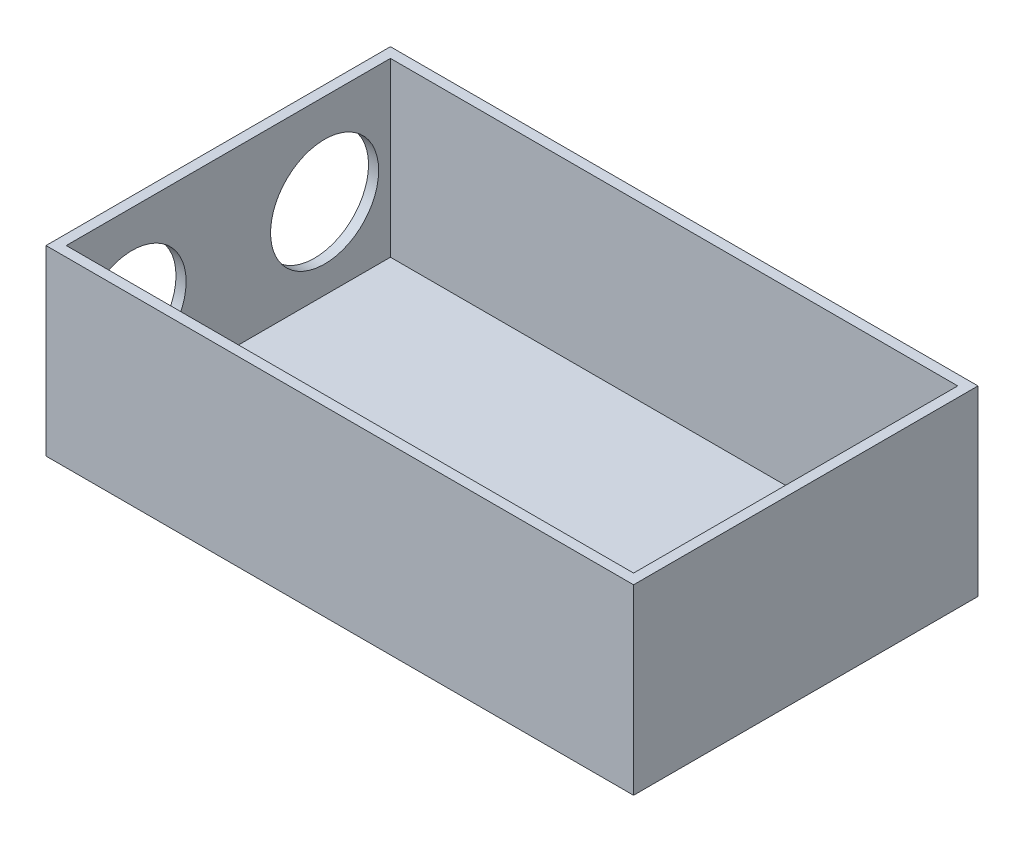
ISO-10303-21;
HEADER;
FILE_DESCRIPTION(('STEP AP214'),'2;1');
FILE_NAME('part.step','',(''),(''),'','','');
FILE_SCHEMA(('AUTOMOTIVE_DESIGN { 1 0 10303 214 1 1 1 1 }'));
ENDSEC;
DATA;
#1=APPLICATION_CONTEXT('core data for automotive mechanical design processes');
#2=APPLICATION_PROTOCOL_DEFINITION('international standard','automotive_design',2000,#1);
#3=PRODUCT_CONTEXT('',#1,'mechanical');
#4=PRODUCT('Part','Part','',(#3));
#5=PRODUCT_RELATED_PRODUCT_CATEGORY('part','',(#4));
#6=PRODUCT_DEFINITION_FORMATION('','',#4);
#7=PRODUCT_DEFINITION_CONTEXT('part definition',#1,'design');
#8=PRODUCT_DEFINITION('design','',#6,#7);
#9=PRODUCT_DEFINITION_SHAPE('','',#8);
#10=(LENGTH_UNIT() NAMED_UNIT(*) SI_UNIT(.MILLI.,.METRE.));
#11=(NAMED_UNIT(*) PLANE_ANGLE_UNIT() SI_UNIT($,.RADIAN.));
#12=(NAMED_UNIT(*) SI_UNIT($,.STERADIAN.) SOLID_ANGLE_UNIT());
#13=UNCERTAINTY_MEASURE_WITH_UNIT(LENGTH_MEASURE(1.E-05),#10,'distance_accuracy_value','');
#14=(GEOMETRIC_REPRESENTATION_CONTEXT(3) GLOBAL_UNCERTAINTY_ASSIGNED_CONTEXT((#13)) GLOBAL_UNIT_ASSIGNED_CONTEXT((#10,
#11,#12)) REPRESENTATION_CONTEXT('',''));
#15=CARTESIAN_POINT('',(0.,0.,0.));
#16=DIRECTION('',(0.,0.,1.));
#17=DIRECTION('',(1.,0.,0.));
#18=AXIS2_PLACEMENT_3D('',#15,#16,#17);
#19=CARTESIAN_POINT('',(180.,45.,-85.));
#20=DIRECTION('',(0.,0.,1.));
#21=DIRECTION('',(1.,0.,0.));
#22=AXIS2_PLACEMENT_3D('',#19,#20,#21);
#23=PLANE('',#22);
#24=DIRECTION('',(-1.,0.,0.));
#25=VECTOR('',#24,1.);
#26=CARTESIAN_POINT('',(180.,-45.,-85.));
#27=LINE('',#26,#25);
#28=CARTESIAN_POINT('',(180.,-45.,-85.));
#29=VERTEX_POINT('',#28);
#30=CARTESIAN_POINT('',(-110.,-45.,-84.9999999999999));
#31=VERTEX_POINT('',#30);
#32=EDGE_CURVE('E169',#29,#31,#27,.T.);
#33=ORIENTED_EDGE('',*,*,#32,.T.);
#34=DIRECTION('',(0.,-1.,0.));
#35=VECTOR('',#34,1.);
#36=CARTESIAN_POINT('',(-110.,45.,-84.9999999999999));
#37=LINE('',#36,#35);
#38=CARTESIAN_POINT('',(-110.,45.,-84.9999999999999));
#39=VERTEX_POINT('',#38);
#40=EDGE_CURVE('E11',#39,#31,#37,.T.);
#41=ORIENTED_EDGE('',*,*,#40,.F.);
#42=DIRECTION('',(-1.,0.,0.));
#43=VECTOR('',#42,1.);
#44=CARTESIAN_POINT('',(180.,45.,-85.));
#45=LINE('',#44,#43);
#46=CARTESIAN_POINT('',(180.,45.,-85.));
#47=VERTEX_POINT('',#46);
#48=EDGE_CURVE('E158',#47,#39,#45,.T.);
#49=ORIENTED_EDGE('',*,*,#48,.F.);
#50=DIRECTION('',(0.,-1.,0.));
#51=VECTOR('',#50,1.);
#52=CARTESIAN_POINT('',(180.,45.,-85.));
#53=LINE('',#52,#51);
#54=EDGE_CURVE('E168',#47,#29,#53,.T.);
#55=ORIENTED_EDGE('',*,*,#54,.T.);
#56=EDGE_LOOP('',(#33,#41,#49,#55));
#57=FACE_BOUND('',#56,.T.);
#58=ADVANCED_FACE('F39',(#57),#23,.F.);
#59=CARTESIAN_POINT('',(-110.,45.,-84.9999999999999));
#60=DIRECTION('',(1.,0.,0.));
#61=DIRECTION('',(0.,0.,-1.));
#62=AXIS2_PLACEMENT_3D('',#59,#60,#61);
#63=PLANE('',#62);
#64=CARTESIAN_POINT('',(-110.,0.,-47.5149842818787));
#65=DIRECTION('',(1.,0.,0.));
#66=DIRECTION('',(0.,0.,-1.));
#67=AXIS2_PLACEMENT_3D('',#64,#65,#66);
#68=CIRCLE('',#67,26.67);
#69=CARTESIAN_POINT('',(-110.,0.,-74.1849842818787));
#70=VERTEX_POINT('',#69);
#71=EDGE_CURVE('E201',#70,#70,#68,.T.);
#72=ORIENTED_EDGE('',*,*,#71,.T.);
#73=EDGE_LOOP('',(#72));
#74=FACE_BOUND('',#73,.T.);
#75=CARTESIAN_POINT('',(-110.,0.,47.5149842818787));
#76=DIRECTION('',(1.,0.,0.));
#77=DIRECTION('',(0.,0.,-1.));
#78=AXIS2_PLACEMENT_3D('',#75,#76,#77);
#79=CIRCLE('',#78,26.67);
#80=CARTESIAN_POINT('',(-110.,0.,20.8449842818787));
#81=VERTEX_POINT('',#80);
#82=EDGE_CURVE('E191',#81,#81,#79,.T.);
#83=ORIENTED_EDGE('',*,*,#82,.T.);
#84=EDGE_LOOP('',(#83));
#85=FACE_BOUND('',#84,.T.);
#86=DIRECTION('',(0.,0.,1.));
#87=VECTOR('',#86,1.);
#88=CARTESIAN_POINT('',(-110.,-45.,-84.9999999999999));
#89=LINE('',#88,#87);
#90=CARTESIAN_POINT('',(-110.,-45.,85.));
#91=VERTEX_POINT('',#90);
#92=EDGE_CURVE('E173',#31,#91,#89,.T.);
#93=ORIENTED_EDGE('',*,*,#92,.T.);
#94=DIRECTION('',(0.,-1.,0.));
#95=VECTOR('',#94,1.);
#96=CARTESIAN_POINT('',(-110.,45.,85.));
#97=LINE('',#96,#95);
#98=CARTESIAN_POINT('',(-110.,45.,85.));
#99=VERTEX_POINT('',#98);
#100=EDGE_CURVE('E48',#99,#91,#97,.T.);
#101=ORIENTED_EDGE('',*,*,#100,.F.);
#102=DIRECTION('',(0.,0.,1.));
#103=VECTOR('',#102,1.);
#104=CARTESIAN_POINT('',(-110.,45.,-84.9999999999999));
#105=LINE('',#104,#103);
#106=EDGE_CURVE('E93',#39,#99,#105,.T.);
#107=ORIENTED_EDGE('',*,*,#106,.F.);
#108=ORIENTED_EDGE('',*,*,#40,.T.);
#109=EDGE_LOOP('',(#93,#101,#107,#108));
#110=FACE_BOUND('',#109,.T.);
#111=ADVANCED_FACE('F228',(#74,#85,#110),#63,.F.);
#112=CARTESIAN_POINT('',(180.,45.,85.));
#113=DIRECTION('',(0.,0.,-1.));
#114=DIRECTION('',(-1.,0.,0.));
#115=AXIS2_PLACEMENT_3D('',#112,#113,#114);
#116=PLANE('',#115);
#117=DIRECTION('',(1.,0.,0.));
#118=VECTOR('',#117,1.);
#119=CARTESIAN_POINT('',(180.,-45.,85.));
#120=LINE('',#119,#118);
#121=CARTESIAN_POINT('',(180.,-45.,85.));
#122=VERTEX_POINT('',#121);
#123=EDGE_CURVE('E176',#91,#122,#120,.T.);
#124=ORIENTED_EDGE('',*,*,#123,.T.);
#125=DIRECTION('',(0.,-1.,0.));
#126=VECTOR('',#125,1.);
#127=CARTESIAN_POINT('',(180.,45.,85.));
#128=LINE('',#127,#126);
#129=CARTESIAN_POINT('',(180.,45.,85.));
#130=VERTEX_POINT('',#129);
#131=EDGE_CURVE('E183',#130,#122,#128,.T.);
#132=ORIENTED_EDGE('',*,*,#131,.F.);
#133=DIRECTION('',(1.,0.,0.));
#134=VECTOR('',#133,1.);
#135=CARTESIAN_POINT('',(180.,45.,85.));
#136=LINE('',#135,#134);
#137=EDGE_CURVE('E163',#99,#130,#136,.T.);
#138=ORIENTED_EDGE('',*,*,#137,.F.);
#139=ORIENTED_EDGE('',*,*,#100,.T.);
#140=EDGE_LOOP('',(#124,#132,#138,#139));
#141=FACE_BOUND('',#140,.T.);
#142=ADVANCED_FACE('F233',(#141),#116,.F.);
#143=CARTESIAN_POINT('',(180.,45.,-85.));
#144=DIRECTION('',(-1.,0.,0.));
#145=DIRECTION('',(0.,0.,1.));
#146=AXIS2_PLACEMENT_3D('',#143,#144,#145);
#147=PLANE('',#146);
#148=DIRECTION('',(0.,0.,-1.));
#149=VECTOR('',#148,1.);
#150=CARTESIAN_POINT('',(180.,-45.,-85.));
#151=LINE('',#150,#149);
#152=EDGE_CURVE('E86',#122,#29,#151,.T.);
#153=ORIENTED_EDGE('',*,*,#152,.T.);
#154=ORIENTED_EDGE('',*,*,#54,.F.);
#155=DIRECTION('',(0.,0.,-1.));
#156=VECTOR('',#155,1.);
#157=CARTESIAN_POINT('',(180.,45.,-85.));
#158=LINE('',#157,#156);
#159=EDGE_CURVE('E65',#130,#47,#158,.T.);
#160=ORIENTED_EDGE('',*,*,#159,.F.);
#161=ORIENTED_EDGE('',*,*,#131,.T.);
#162=EDGE_LOOP('',(#153,#154,#160,#161));
#163=FACE_BOUND('',#162,.T.);
#164=ADVANCED_FACE('F222',(#163),#147,.F.);
#165=CARTESIAN_POINT('',(0.,45.,0.));
#166=DIRECTION('',(0.,1.,0.));
#167=DIRECTION('',(0.,0.,1.));
#168=AXIS2_PLACEMENT_3D('',#165,#166,#167);
#169=PLANE('',#168);
#170=DIRECTION('',(-1.,0.,0.));
#171=VECTOR('',#170,1.);
#172=CARTESIAN_POINT('',(180.,45.,-80.));
#173=LINE('',#172,#171);
#174=CARTESIAN_POINT('',(175.,45.,-80.));
#175=VERTEX_POINT('',#174);
#176=CARTESIAN_POINT('',(-105.,45.,-79.9999999999999));
#177=VERTEX_POINT('',#176);
#178=EDGE_CURVE('E142',#175,#177,#173,.T.);
#179=ORIENTED_EDGE('',*,*,#178,.F.);
#180=DIRECTION('',(0.,0.,-1.));
#181=VECTOR('',#180,1.);
#182=CARTESIAN_POINT('',(175.,45.,-85.));
#183=LINE('',#182,#181);
#184=CARTESIAN_POINT('',(175.,45.,80.));
#185=VERTEX_POINT('',#184);
#186=EDGE_CURVE('E155',#185,#175,#183,.T.);
#187=ORIENTED_EDGE('',*,*,#186,.F.);
#188=DIRECTION('',(1.,0.,0.));
#189=VECTOR('',#188,1.);
#190=CARTESIAN_POINT('',(180.,45.,80.));
#191=LINE('',#190,#189);
#192=CARTESIAN_POINT('',(-105.,45.,80.));
#193=VERTEX_POINT('',#192);
#194=EDGE_CURVE('E152',#193,#185,#191,.T.);
#195=ORIENTED_EDGE('',*,*,#194,.F.);
#196=DIRECTION('',(0.,0.,1.));
#197=VECTOR('',#196,1.);
#198=CARTESIAN_POINT('',(-105.,45.,-84.9999999999999));
#199=LINE('',#198,#197);
#200=EDGE_CURVE('E131',#177,#193,#199,.T.);
#201=ORIENTED_EDGE('',*,*,#200,.F.);
#202=EDGE_LOOP('',(#179,#187,#195,#201));
#203=FACE_BOUND('',#202,.T.);
#204=ORIENTED_EDGE('',*,*,#48,.T.);
#205=ORIENTED_EDGE('',*,*,#106,.T.);
#206=ORIENTED_EDGE('',*,*,#137,.T.);
#207=ORIENTED_EDGE('',*,*,#159,.T.);
#208=EDGE_LOOP('',(#204,#205,#206,#207));
#209=FACE_BOUND('',#208,.T.);
#210=ADVANCED_FACE('F219',(#203,#209),#169,.T.);
#211=CARTESIAN_POINT('',(0.,-45.,0.));
#212=DIRECTION('',(0.,1.,0.));
#213=DIRECTION('',(0.,0.,1.));
#214=AXIS2_PLACEMENT_3D('',#211,#212,#213);
#215=PLANE('',#214);
#216=ORIENTED_EDGE('',*,*,#32,.F.);
#217=ORIENTED_EDGE('',*,*,#152,.F.);
#218=ORIENTED_EDGE('',*,*,#123,.F.);
#219=ORIENTED_EDGE('',*,*,#92,.F.);
#220=EDGE_LOOP('',(#216,#217,#218,#219));
#221=FACE_BOUND('',#220,.T.);
#222=ADVANCED_FACE('F221',(#221),#215,.F.);
#223=CARTESIAN_POINT('',(180.,45.,-80.));
#224=DIRECTION('',(0.,0.,1.));
#225=DIRECTION('',(1.,0.,0.));
#226=AXIS2_PLACEMENT_3D('',#223,#224,#225);
#227=PLANE('',#226);
#228=DIRECTION('',(-1.,0.,0.));
#229=VECTOR('',#228,1.);
#230=CARTESIAN_POINT('',(180.,-40.,-80.));
#231=LINE('',#230,#229);
#232=CARTESIAN_POINT('',(175.,-40.,-80.));
#233=VERTEX_POINT('',#232);
#234=CARTESIAN_POINT('',(-105.,-40.,-79.9999999999999));
#235=VERTEX_POINT('',#234);
#236=EDGE_CURVE('E121',#233,#235,#231,.T.);
#237=ORIENTED_EDGE('',*,*,#236,.F.);
#238=DIRECTION('',(0.,-1.,0.));
#239=VECTOR('',#238,1.);
#240=CARTESIAN_POINT('',(175.,45.,-80.));
#241=LINE('',#240,#239);
#242=EDGE_CURVE('E146',#175,#233,#241,.T.);
#243=ORIENTED_EDGE('',*,*,#242,.F.);
#244=ORIENTED_EDGE('',*,*,#178,.T.);
#245=DIRECTION('',(0.,-1.,0.));
#246=VECTOR('',#245,1.);
#247=CARTESIAN_POINT('',(-105.,45.,-79.9999999999999));
#248=LINE('',#247,#246);
#249=EDGE_CURVE('E135',#177,#235,#248,.T.);
#250=ORIENTED_EDGE('',*,*,#249,.T.);
#251=EDGE_LOOP('',(#237,#243,#244,#250));
#252=FACE_BOUND('',#251,.T.);
#253=ADVANCED_FACE('F217',(#252),#227,.T.);
#254=CARTESIAN_POINT('',(-105.,45.,-84.9999999999999));
#255=DIRECTION('',(1.,0.,0.));
#256=DIRECTION('',(0.,0.,-1.));
#257=AXIS2_PLACEMENT_3D('',#254,#255,#256);
#258=PLANE('',#257);
#259=CARTESIAN_POINT('',(-105.,0.,-47.5149842818787));
#260=DIRECTION('',(1.,0.,0.));
#261=DIRECTION('',(0.,0.,-1.));
#262=AXIS2_PLACEMENT_3D('',#259,#260,#261);
#263=CIRCLE('',#262,26.67);
#264=CARTESIAN_POINT('',(-105.,0.,-74.1849842818787));
#265=VERTEX_POINT('',#264);
#266=EDGE_CURVE('E42',#265,#265,#263,.T.);
#267=ORIENTED_EDGE('',*,*,#266,.F.);
#268=EDGE_LOOP('',(#267));
#269=FACE_BOUND('',#268,.T.);
#270=CARTESIAN_POINT('',(-105.,0.,47.5149842818787));
#271=DIRECTION('',(1.,0.,0.));
#272=DIRECTION('',(0.,0.,-1.));
#273=AXIS2_PLACEMENT_3D('',#270,#271,#272);
#274=CIRCLE('',#273,26.67);
#275=CARTESIAN_POINT('',(-105.,0.,20.8449842818787));
#276=VERTEX_POINT('',#275);
#277=EDGE_CURVE('E188',#276,#276,#274,.T.);
#278=ORIENTED_EDGE('',*,*,#277,.F.);
#279=EDGE_LOOP('',(#278));
#280=FACE_BOUND('',#279,.T.);
#281=DIRECTION('',(0.,0.,1.));
#282=VECTOR('',#281,1.);
#283=CARTESIAN_POINT('',(-105.,-40.,-84.9999999999999));
#284=LINE('',#283,#282);
#285=CARTESIAN_POINT('',(-105.,-40.,80.));
#286=VERTEX_POINT('',#285);
#287=EDGE_CURVE('E115',#235,#286,#284,.T.);
#288=ORIENTED_EDGE('',*,*,#287,.F.);
#289=ORIENTED_EDGE('',*,*,#249,.F.);
#290=ORIENTED_EDGE('',*,*,#200,.T.);
#291=DIRECTION('',(0.,-1.,0.));
#292=VECTOR('',#291,1.);
#293=CARTESIAN_POINT('',(-105.,45.,80.));
#294=LINE('',#293,#292);
#295=EDGE_CURVE('E128',#193,#286,#294,.T.);
#296=ORIENTED_EDGE('',*,*,#295,.T.);
#297=EDGE_LOOP('',(#288,#289,#290,#296));
#298=FACE_BOUND('',#297,.T.);
#299=ADVANCED_FACE('F129',(#269,#280,#298),#258,.T.);
#300=CARTESIAN_POINT('',(180.,45.,80.));
#301=DIRECTION('',(0.,0.,-1.));
#302=DIRECTION('',(-1.,0.,0.));
#303=AXIS2_PLACEMENT_3D('',#300,#301,#302);
#304=PLANE('',#303);
#305=DIRECTION('',(1.,0.,0.));
#306=VECTOR('',#305,1.);
#307=CARTESIAN_POINT('',(180.,-40.,80.));
#308=LINE('',#307,#306);
#309=CARTESIAN_POINT('',(175.,-40.,80.));
#310=VERTEX_POINT('',#309);
#311=EDGE_CURVE('E119',#286,#310,#308,.T.);
#312=ORIENTED_EDGE('',*,*,#311,.F.);
#313=ORIENTED_EDGE('',*,*,#295,.F.);
#314=ORIENTED_EDGE('',*,*,#194,.T.);
#315=DIRECTION('',(0.,-1.,0.));
#316=VECTOR('',#315,1.);
#317=CARTESIAN_POINT('',(175.,45.,80.));
#318=LINE('',#317,#316);
#319=EDGE_CURVE('E56',#185,#310,#318,.T.);
#320=ORIENTED_EDGE('',*,*,#319,.T.);
#321=EDGE_LOOP('',(#312,#313,#314,#320));
#322=FACE_BOUND('',#321,.T.);
#323=ADVANCED_FACE('F137',(#322),#304,.T.);
#324=CARTESIAN_POINT('',(175.,45.,-85.));
#325=DIRECTION('',(-1.,0.,0.));
#326=DIRECTION('',(0.,0.,1.));
#327=AXIS2_PLACEMENT_3D('',#324,#325,#326);
#328=PLANE('',#327);
#329=DIRECTION('',(0.,0.,-1.));
#330=VECTOR('',#329,1.);
#331=CARTESIAN_POINT('',(175.,-40.,-85.));
#332=LINE('',#331,#330);
#333=EDGE_CURVE('E139',#310,#233,#332,.T.);
#334=ORIENTED_EDGE('',*,*,#333,.F.);
#335=ORIENTED_EDGE('',*,*,#319,.F.);
#336=ORIENTED_EDGE('',*,*,#186,.T.);
#337=ORIENTED_EDGE('',*,*,#242,.T.);
#338=EDGE_LOOP('',(#334,#335,#336,#337));
#339=FACE_BOUND('',#338,.T.);
#340=ADVANCED_FACE('F213',(#339),#328,.T.);
#341=CARTESIAN_POINT('',(0.,-40.,0.));
#342=DIRECTION('',(0.,1.,0.));
#343=DIRECTION('',(0.,0.,1.));
#344=AXIS2_PLACEMENT_3D('',#341,#342,#343);
#345=PLANE('',#344);
#346=ORIENTED_EDGE('',*,*,#236,.T.);
#347=ORIENTED_EDGE('',*,*,#287,.T.);
#348=ORIENTED_EDGE('',*,*,#311,.T.);
#349=ORIENTED_EDGE('',*,*,#333,.T.);
#350=EDGE_LOOP('',(#346,#347,#348,#349));
#351=FACE_BOUND('',#350,.T.);
#352=ADVANCED_FACE('F117',(#351),#345,.T.);
#353=CARTESIAN_POINT('',(-70.,0.,47.5149842818787));
#354=DIRECTION('',(-1.,0.,0.));
#355=DIRECTION('',(0.,0.,1.));
#356=AXIS2_PLACEMENT_3D('',#353,#354,#355);
#357=CYLINDRICAL_SURFACE('',#356,26.67);
#358=ORIENTED_EDGE('',*,*,#277,.T.);
#359=EDGE_LOOP('',(#358));
#360=FACE_BOUND('',#359,.T.);
#361=ORIENTED_EDGE('',*,*,#82,.F.);
#362=EDGE_LOOP('',(#361));
#363=FACE_BOUND('',#362,.T.);
#364=ADVANCED_FACE('F294',(#360,#363),#357,.F.);
#365=CARTESIAN_POINT('',(-70.,0.,-47.5149842818787));
#366=DIRECTION('',(-1.,0.,0.));
#367=DIRECTION('',(0.,0.,1.));
#368=AXIS2_PLACEMENT_3D('',#365,#366,#367);
#369=CYLINDRICAL_SURFACE('',#368,26.67);
#370=ORIENTED_EDGE('',*,*,#266,.T.);
#371=EDGE_LOOP('',(#370));
#372=FACE_BOUND('',#371,.T.);
#373=ORIENTED_EDGE('',*,*,#71,.F.);
#374=EDGE_LOOP('',(#373));
#375=FACE_BOUND('',#374,.T.);
#376=ADVANCED_FACE('F317',(#372,#375),#369,.F.);
#377=CLOSED_SHELL('',(#58,#111,#142,#164,#210,#222,#253,#299,#323,#340,#352,#364,#376));
#378=MANIFOLD_SOLID_BREP('B2',#377);
#379=ADVANCED_BREP_SHAPE_REPRESENTATION('',(#18,#378),#14);
#380=SHAPE_DEFINITION_REPRESENTATION(#9,#379);
ENDSEC;
END-ISO-10303-21;
